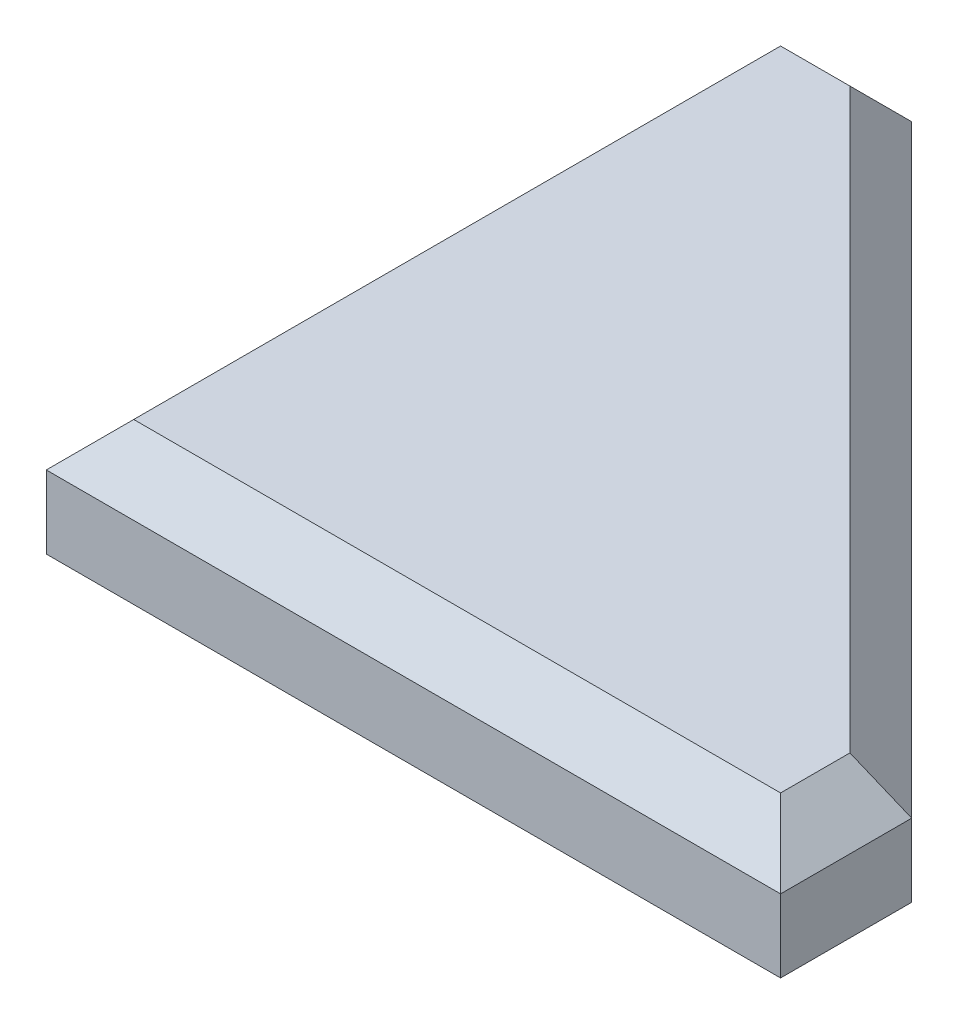
ISO-10303-21;
HEADER;
FILE_DESCRIPTION(('STEP AP214'),'2;1');
FILE_NAME('part.step','',(''),(''),'','','');
FILE_SCHEMA(('AUTOMOTIVE_DESIGN { 1 0 10303 214 1 1 1 1 }'));
ENDSEC;
DATA;
#1=APPLICATION_CONTEXT('core data for automotive mechanical design processes');
#2=APPLICATION_PROTOCOL_DEFINITION('international standard','automotive_design',2000,#1);
#3=PRODUCT_CONTEXT('',#1,'mechanical');
#4=PRODUCT('Part','Part','',(#3));
#5=PRODUCT_RELATED_PRODUCT_CATEGORY('part','',(#4));
#6=PRODUCT_DEFINITION_FORMATION('','',#4);
#7=PRODUCT_DEFINITION_CONTEXT('part definition',#1,'design');
#8=PRODUCT_DEFINITION('design','',#6,#7);
#9=PRODUCT_DEFINITION_SHAPE('','',#8);
#10=(LENGTH_UNIT() NAMED_UNIT(*) SI_UNIT(.MILLI.,.METRE.));
#11=(NAMED_UNIT(*) PLANE_ANGLE_UNIT() SI_UNIT($,.RADIAN.));
#12=(NAMED_UNIT(*) SI_UNIT($,.STERADIAN.) SOLID_ANGLE_UNIT());
#13=UNCERTAINTY_MEASURE_WITH_UNIT(LENGTH_MEASURE(1.E-05),#10,'distance_accuracy_value','');
#14=(GEOMETRIC_REPRESENTATION_CONTEXT(3) GLOBAL_UNCERTAINTY_ASSIGNED_CONTEXT((#13)) GLOBAL_UNIT_ASSIGNED_CONTEXT((#10,
#11,#12)) REPRESENTATION_CONTEXT('',''));
#15=CARTESIAN_POINT('',(0.,0.,0.));
#16=DIRECTION('',(0.,0.,1.));
#17=DIRECTION('',(1.,0.,0.));
#18=AXIS2_PLACEMENT_3D('',#15,#16,#17);
#19=CARTESIAN_POINT('',(50.39696961967,8.,0.));
#20=DIRECTION('',(0.,0.,-1.));
#21=DIRECTION('',(-1.,0.,0.));
#22=AXIS2_PLACEMENT_3D('',#19,#20,#21);
#23=PLANE('',#22);
#24=DIRECTION('',(0.,-1.,0.));
#25=VECTOR('',#24,1.);
#26=CARTESIAN_POINT('',(50.39696961967,8.,0.));
#27=LINE('',#26,#25);
#28=CARTESIAN_POINT('',(50.39696961967,4.99999999999999,0.));
#29=VERTEX_POINT('',#28);
#30=CARTESIAN_POINT('',(50.39696961967,0.,0.));
#31=VERTEX_POINT('',#30);
#32=EDGE_CURVE('E105',#29,#31,#27,.T.);
#33=ORIENTED_EDGE('',*,*,#32,.F.);
#34=DIRECTION('',(-1.,0.,0.));
#35=VECTOR('',#34,1.);
#36=CARTESIAN_POINT('',(50.39696961967,4.99999999999999,0.));
#37=LINE('',#36,#35);
#38=CARTESIAN_POINT('',(0.,4.99999999999999,0.));
#39=VERTEX_POINT('',#38);
#40=EDGE_CURVE('E173',#29,#39,#37,.T.);
#41=ORIENTED_EDGE('',*,*,#40,.T.);
#42=DIRECTION('',(0.,-1.,0.));
#43=VECTOR('',#42,1.);
#44=CARTESIAN_POINT('',(0.,8.,0.));
#45=LINE('',#44,#43);
#46=CARTESIAN_POINT('',(0.,0.,0.));
#47=VERTEX_POINT('',#46);
#48=EDGE_CURVE('E131',#39,#47,#45,.T.);
#49=ORIENTED_EDGE('',*,*,#48,.T.);
#50=DIRECTION('',(1.,0.,0.));
#51=VECTOR('',#50,1.);
#52=CARTESIAN_POINT('',(50.39696961967,0.,0.));
#53=LINE('',#52,#51);
#54=EDGE_CURVE('E125',#47,#31,#53,.T.);
#55=ORIENTED_EDGE('',*,*,#54,.T.);
#56=EDGE_LOOP('',(#33,#41,#49,#55));
#57=FACE_BOUND('',#56,.T.);
#58=ADVANCED_FACE('F41',(#57),#23,.F.);
#59=CARTESIAN_POINT('',(50.39696961967,8.,-9.));
#60=DIRECTION('',(-1.,0.,0.));
#61=DIRECTION('',(0.,0.,1.));
#62=AXIS2_PLACEMENT_3D('',#59,#60,#61);
#63=PLANE('',#62);
#64=DIRECTION('',(0.,-1.,0.));
#65=VECTOR('',#64,1.);
#66=CARTESIAN_POINT('',(50.39696961967,8.,-9.));
#67=LINE('',#66,#65);
#68=CARTESIAN_POINT('',(50.39696961967,4.99999999999999,-9.));
#69=VERTEX_POINT('',#68);
#70=CARTESIAN_POINT('',(50.39696961967,0.,-9.));
#71=VERTEX_POINT('',#70);
#72=EDGE_CURVE('E119',#69,#71,#67,.T.);
#73=ORIENTED_EDGE('',*,*,#72,.F.);
#74=DIRECTION('',(0.,0.,1.));
#75=VECTOR('',#74,1.);
#76=CARTESIAN_POINT('',(50.39696961967,4.99999999999999,-9.));
#77=LINE('',#76,#75);
#78=EDGE_CURVE('E112',#69,#29,#77,.T.);
#79=ORIENTED_EDGE('',*,*,#78,.T.);
#80=ORIENTED_EDGE('',*,*,#32,.T.);
#81=DIRECTION('',(0.,0.,-1.));
#82=VECTOR('',#81,1.);
#83=CARTESIAN_POINT('',(50.39696961967,0.,-9.));
#84=LINE('',#83,#82);
#85=EDGE_CURVE('E109',#31,#71,#84,.T.);
#86=ORIENTED_EDGE('',*,*,#85,.T.);
#87=EDGE_LOOP('',(#73,#79,#80,#86));
#88=FACE_BOUND('',#87,.T.);
#89=ADVANCED_FACE('F108',(#88),#63,.F.);
#90=CARTESIAN_POINT('',(9.,8.,-50.39696961967));
#91=DIRECTION('',(-0.707106781186547,0.,0.707106781186547));
#92=DIRECTION('',(0.707106781186548,0.,0.707106781186548));
#93=AXIS2_PLACEMENT_3D('',#90,#91,#92);
#94=PLANE('',#93);
#95=DIRECTION('',(0.,-1.,0.));
#96=VECTOR('',#95,1.);
#97=CARTESIAN_POINT('',(9.,8.,-50.39696961967));
#98=LINE('',#97,#96);
#99=CARTESIAN_POINT('',(9.,4.99999999999999,-50.39696961967));
#100=VERTEX_POINT('',#99);
#101=CARTESIAN_POINT('',(9.,0.,-50.39696961967));
#102=VERTEX_POINT('',#101);
#103=EDGE_CURVE('E153',#100,#102,#98,.T.);
#104=ORIENTED_EDGE('',*,*,#103,.F.);
#105=DIRECTION('',(0.707106781186548,0.,0.707106781186548));
#106=VECTOR('',#105,1.);
#107=CARTESIAN_POINT('',(9.,4.99999999999999,-50.39696961967));
#108=LINE('',#107,#106);
#109=EDGE_CURVE('E178',#100,#69,#108,.T.);
#110=ORIENTED_EDGE('',*,*,#109,.T.);
#111=ORIENTED_EDGE('',*,*,#72,.T.);
#112=DIRECTION('',(-0.707106781186547,0.,-0.707106781186547));
#113=VECTOR('',#112,1.);
#114=CARTESIAN_POINT('',(9.,0.,-50.39696961967));
#115=LINE('',#114,#113);
#116=EDGE_CURVE('E128',#71,#102,#115,.T.);
#117=ORIENTED_EDGE('',*,*,#116,.T.);
#118=EDGE_LOOP('',(#104,#110,#111,#117));
#119=FACE_BOUND('',#118,.T.);
#120=ADVANCED_FACE('F208',(#119),#94,.F.);
#121=CARTESIAN_POINT('',(0.,8.,-50.39696961967));
#122=DIRECTION('',(0.,0.,1.));
#123=DIRECTION('',(1.,0.,0.));
#124=AXIS2_PLACEMENT_3D('',#121,#122,#123);
#125=PLANE('',#124);
#126=DIRECTION('',(0.,-1.,0.));
#127=VECTOR('',#126,1.);
#128=CARTESIAN_POINT('',(0.,8.,-50.39696961967));
#129=LINE('',#128,#127);
#130=CARTESIAN_POINT('',(0.,4.99999999999999,-50.39696961967));
#131=VERTEX_POINT('',#130);
#132=CARTESIAN_POINT('',(0.,0.,-50.39696961967));
#133=VERTEX_POINT('',#132);
#134=EDGE_CURVE('E150',#131,#133,#129,.T.);
#135=ORIENTED_EDGE('',*,*,#134,.F.);
#136=DIRECTION('',(1.,0.,0.));
#137=VECTOR('',#136,1.);
#138=CARTESIAN_POINT('',(0.,4.99999999999999,-50.39696961967));
#139=LINE('',#138,#137);
#140=EDGE_CURVE('E52',#131,#100,#139,.T.);
#141=ORIENTED_EDGE('',*,*,#140,.T.);
#142=ORIENTED_EDGE('',*,*,#103,.T.);
#143=DIRECTION('',(-1.,0.,0.));
#144=VECTOR('',#143,1.);
#145=CARTESIAN_POINT('',(0.,0.,-50.39696961967));
#146=LINE('',#145,#144);
#147=EDGE_CURVE('E141',#102,#133,#146,.T.);
#148=ORIENTED_EDGE('',*,*,#147,.T.);
#149=EDGE_LOOP('',(#135,#141,#142,#148));
#150=FACE_BOUND('',#149,.T.);
#151=ADVANCED_FACE('F209',(#150),#125,.F.);
#152=CARTESIAN_POINT('',(0.,8.,0.));
#153=DIRECTION('',(1.,0.,0.));
#154=DIRECTION('',(0.,0.,-1.));
#155=AXIS2_PLACEMENT_3D('',#152,#153,#154);
#156=PLANE('',#155);
#157=ORIENTED_EDGE('',*,*,#48,.F.);
#158=DIRECTION('',(0.,0.,-1.));
#159=VECTOR('',#158,1.);
#160=CARTESIAN_POINT('',(0.,4.99999999999999,0.));
#161=LINE('',#160,#159);
#162=EDGE_CURVE('E11',#39,#131,#161,.T.);
#163=ORIENTED_EDGE('',*,*,#162,.T.);
#164=ORIENTED_EDGE('',*,*,#134,.T.);
#165=DIRECTION('',(0.,0.,1.));
#166=VECTOR('',#165,1.);
#167=CARTESIAN_POINT('',(0.,0.,0.));
#168=LINE('',#167,#166);
#169=EDGE_CURVE('E145',#133,#47,#168,.T.);
#170=ORIENTED_EDGE('',*,*,#169,.T.);
#171=EDGE_LOOP('',(#157,#163,#164,#170));
#172=FACE_BOUND('',#171,.T.);
#173=ADVANCED_FACE('F210',(#172),#156,.F.);
#174=CARTESIAN_POINT('',(0.,8.,0.));
#175=DIRECTION('',(0.,-1.,0.));
#176=DIRECTION('',(0.,0.,-1.));
#177=AXIS2_PLACEMENT_3D('',#174,#175,#176);
#178=PLANE('',#177);
#179=DIRECTION('',(0.,0.,1.));
#180=VECTOR('',#179,1.);
#181=CARTESIAN_POINT('',(3.,8.,0.));
#182=LINE('',#181,#180);
#183=CARTESIAN_POINT('',(3.,8.,-47.39696961967));
#184=VERTEX_POINT('',#183);
#185=CARTESIAN_POINT('',(3.,8.,-3.));
#186=VERTEX_POINT('',#185);
#187=EDGE_CURVE('E118',#184,#186,#182,.T.);
#188=ORIENTED_EDGE('',*,*,#187,.T.);
#189=DIRECTION('',(1.,0.,0.));
#190=VECTOR('',#189,1.);
#191=CARTESIAN_POINT('',(0.,8.,-3.));
#192=LINE('',#191,#190);
#193=CARTESIAN_POINT('',(47.39696961967,8.,-3.));
#194=VERTEX_POINT('',#193);
#195=EDGE_CURVE('E169',#186,#194,#192,.T.);
#196=ORIENTED_EDGE('',*,*,#195,.T.);
#197=DIRECTION('',(0.,0.,-1.));
#198=VECTOR('',#197,1.);
#199=CARTESIAN_POINT('',(47.39696961967,8.,0.));
#200=LINE('',#199,#198);
#201=CARTESIAN_POINT('',(47.39696961967,8.,-7.75735931288071));
#202=VERTEX_POINT('',#201);
#203=EDGE_CURVE('E166',#194,#202,#200,.T.);
#204=ORIENTED_EDGE('',*,*,#203,.T.);
#205=DIRECTION('',(-0.707106781186548,0.,-0.707106781186548));
#206=VECTOR('',#205,1.);
#207=CARTESIAN_POINT('',(27.5771644662754,8.,-27.5771644662754));
#208=LINE('',#207,#206);
#209=CARTESIAN_POINT('',(7.75735931288072,8.,-47.39696961967));
#210=VERTEX_POINT('',#209);
#211=EDGE_CURVE('E163',#202,#210,#208,.T.);
#212=ORIENTED_EDGE('',*,*,#211,.T.);
#213=DIRECTION('',(-1.,0.,0.));
#214=VECTOR('',#213,1.);
#215=CARTESIAN_POINT('',(0.,8.,-47.39696961967));
#216=LINE('',#215,#214);
#217=EDGE_CURVE('E160',#210,#184,#216,.T.);
#218=ORIENTED_EDGE('',*,*,#217,.T.);
#219=EDGE_LOOP('',(#188,#196,#204,#212,#218));
#220=FACE_BOUND('',#219,.T.);
#221=ADVANCED_FACE('F212',(#220),#178,.F.);
#222=CARTESIAN_POINT('',(0.,0.,0.));
#223=DIRECTION('',(0.,-1.,0.));
#224=DIRECTION('',(0.,0.,-1.));
#225=AXIS2_PLACEMENT_3D('',#222,#223,#224);
#226=PLANE('',#225);
#227=ORIENTED_EDGE('',*,*,#54,.F.);
#228=ORIENTED_EDGE('',*,*,#169,.F.);
#229=ORIENTED_EDGE('',*,*,#147,.F.);
#230=ORIENTED_EDGE('',*,*,#116,.F.);
#231=ORIENTED_EDGE('',*,*,#85,.F.);
#232=EDGE_LOOP('',(#227,#228,#229,#230,#231));
#233=FACE_BOUND('',#232,.T.);
#234=ADVANCED_FACE('F123',(#233),#226,.T.);
#235=CARTESIAN_POINT('',(0.,8.,-47.39696961967));
#236=DIRECTION('',(0.,-0.707106781186547,0.707106781186548));
#237=DIRECTION('',(-1.,0.,0.));
#238=AXIS2_PLACEMENT_3D('',#235,#236,#237);
#239=PLANE('',#238);
#240=DIRECTION('',(-0.577350269189625,-0.577350269189627,-0.577350269189625));
#241=VECTOR('',#240,1.);
#242=CARTESIAN_POINT('',(18.7989898732233,23.7989898732233,-31.5979797464467));
#243=LINE('',#242,#241);
#244=EDGE_CURVE('E137',#184,#131,#243,.T.);
#245=ORIENTED_EDGE('',*,*,#244,.F.);
#246=ORIENTED_EDGE('',*,*,#217,.F.);
#247=DIRECTION('',(0.28108463771482,-0.678598344545848,-0.678598344545846));
#248=VECTOR('',#247,1.);
#249=CARTESIAN_POINT('',(7.14446141898328,9.4796664077971,-45.9173032118729));
#250=LINE('',#249,#248);
#251=EDGE_CURVE('E46',#100,#210,#250,.F.);
#252=ORIENTED_EDGE('',*,*,#251,.F.);
#253=ORIENTED_EDGE('',*,*,#140,.F.);
#254=EDGE_LOOP('',(#245,#246,#252,#253));
#255=FACE_BOUND('',#254,.T.);
#256=ADVANCED_FACE('F44',(#255),#239,.F.);
#257=CARTESIAN_POINT('',(27.5771644662754,8.,-27.5771644662754));
#258=DIRECTION('',(-0.500000000000001,-0.707106781186547,0.500000000000001));
#259=DIRECTION('',(-0.707106781186548,0.,-0.707106781186548));
#260=AXIS2_PLACEMENT_3D('',#257,#258,#259);
#261=PLANE('',#260);
#262=ORIENTED_EDGE('',*,*,#251,.T.);
#263=ORIENTED_EDGE('',*,*,#211,.F.);
#264=DIRECTION('',(0.678598344545846,-0.678598344545848,-0.28108463771482));
#265=VECTOR('',#264,1.);
#266=CARTESIAN_POINT('',(42.0505346979732,13.3464349216968,-5.54279345796878));
#267=LINE('',#266,#265);
#268=EDGE_CURVE('E189',#69,#202,#267,.F.);
#269=ORIENTED_EDGE('',*,*,#268,.F.);
#270=ORIENTED_EDGE('',*,*,#109,.F.);
#271=EDGE_LOOP('',(#262,#263,#269,#270));
#272=FACE_BOUND('',#271,.T.);
#273=ADVANCED_FACE('F206',(#272),#261,.F.);
#274=CARTESIAN_POINT('',(3.,8.,0.));
#275=DIRECTION('',(0.707106781186548,-0.707106781186547,0.));
#276=DIRECTION('',(0.,0.,1.));
#277=AXIS2_PLACEMENT_3D('',#274,#275,#276);
#278=PLANE('',#277);
#279=ORIENTED_EDGE('',*,*,#244,.T.);
#280=ORIENTED_EDGE('',*,*,#162,.F.);
#281=DIRECTION('',(0.577350269189625,0.577350269189627,-0.577350269189625));
#282=VECTOR('',#281,1.);
#283=CARTESIAN_POINT('',(2.,7.,-2.));
#284=LINE('',#283,#282);
#285=EDGE_CURVE('E186',#186,#39,#284,.F.);
#286=ORIENTED_EDGE('',*,*,#285,.F.);
#287=ORIENTED_EDGE('',*,*,#187,.F.);
#288=EDGE_LOOP('',(#279,#280,#286,#287));
#289=FACE_BOUND('',#288,.T.);
#290=ADVANCED_FACE('F197',(#289),#278,.F.);
#291=CARTESIAN_POINT('',(47.39696961967,8.,0.));
#292=DIRECTION('',(-0.707106781186548,-0.707106781186547,0.));
#293=DIRECTION('',(0.,0.,-1.));
#294=AXIS2_PLACEMENT_3D('',#291,#292,#293);
#295=PLANE('',#294);
#296=ORIENTED_EDGE('',*,*,#268,.T.);
#297=ORIENTED_EDGE('',*,*,#203,.F.);
#298=DIRECTION('',(0.577350269189625,-0.577350269189627,0.577350269189625));
#299=VECTOR('',#298,1.);
#300=CARTESIAN_POINT('',(48.39696961967,7.,-2.));
#301=LINE('',#300,#299);
#302=EDGE_CURVE('E183',#29,#194,#301,.F.);
#303=ORIENTED_EDGE('',*,*,#302,.F.);
#304=ORIENTED_EDGE('',*,*,#78,.F.);
#305=EDGE_LOOP('',(#296,#297,#303,#304));
#306=FACE_BOUND('',#305,.T.);
#307=ADVANCED_FACE('F237',(#306),#295,.F.);
#308=CARTESIAN_POINT('',(0.,8.,-3.));
#309=DIRECTION('',(0.,-0.707106781186547,-0.707106781186548));
#310=DIRECTION('',(1.,0.,0.));
#311=AXIS2_PLACEMENT_3D('',#308,#309,#310);
#312=PLANE('',#311);
#313=ORIENTED_EDGE('',*,*,#285,.T.);
#314=ORIENTED_EDGE('',*,*,#40,.F.);
#315=ORIENTED_EDGE('',*,*,#302,.T.);
#316=ORIENTED_EDGE('',*,*,#195,.F.);
#317=EDGE_LOOP('',(#313,#314,#315,#316));
#318=FACE_BOUND('',#317,.T.);
#319=ADVANCED_FACE('F231',(#318),#312,.F.);
#320=CLOSED_SHELL('',(#58,#89,#120,#151,#173,#221,#234,#256,#273,#290,#307,#319));
#321=MANIFOLD_SOLID_BREP('B2',#320);
#322=ADVANCED_BREP_SHAPE_REPRESENTATION('',(#18,#321),#14);
#323=SHAPE_DEFINITION_REPRESENTATION(#9,#322);
ENDSEC;
END-ISO-10303-21;
